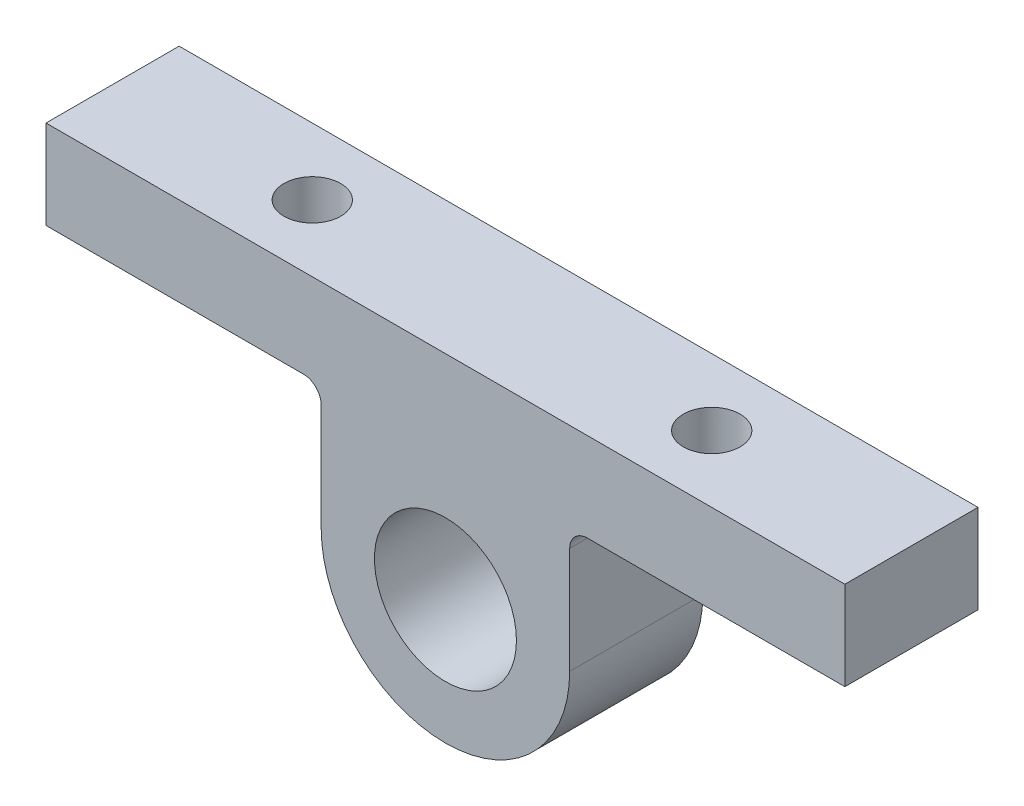
ISO-10303-21;
HEADER;
FILE_DESCRIPTION(('STEP AP214'),'2;1');
FILE_NAME('part.step','',(''),(''),'','','');
FILE_SCHEMA(('AUTOMOTIVE_DESIGN { 1 0 10303 214 1 1 1 1 }'));
ENDSEC;
DATA;
#1=APPLICATION_CONTEXT('core data for automotive mechanical design processes');
#2=APPLICATION_PROTOCOL_DEFINITION('international standard','automotive_design',2000,#1);
#3=PRODUCT_CONTEXT('',#1,'mechanical');
#4=PRODUCT('Part','Part','',(#3));
#5=PRODUCT_RELATED_PRODUCT_CATEGORY('part','',(#4));
#6=PRODUCT_DEFINITION_FORMATION('','',#4);
#7=PRODUCT_DEFINITION_CONTEXT('part definition',#1,'design');
#8=PRODUCT_DEFINITION('design','',#6,#7);
#9=PRODUCT_DEFINITION_SHAPE('','',#8);
#10=(LENGTH_UNIT() NAMED_UNIT(*) SI_UNIT(.MILLI.,.METRE.));
#11=(NAMED_UNIT(*) PLANE_ANGLE_UNIT() SI_UNIT($,.RADIAN.));
#12=(NAMED_UNIT(*) SI_UNIT($,.STERADIAN.) SOLID_ANGLE_UNIT());
#13=UNCERTAINTY_MEASURE_WITH_UNIT(LENGTH_MEASURE(1.E-05),#10,'distance_accuracy_value','');
#14=(GEOMETRIC_REPRESENTATION_CONTEXT(3) GLOBAL_UNCERTAINTY_ASSIGNED_CONTEXT((#13)) GLOBAL_UNIT_ASSIGNED_CONTEXT((#10,
#11,#12)) REPRESENTATION_CONTEXT('',''));
#15=CARTESIAN_POINT('',(0.,0.,0.));
#16=DIRECTION('',(0.,0.,1.));
#17=DIRECTION('',(1.,0.,0.));
#18=AXIS2_PLACEMENT_3D('',#15,#16,#17);
#19=CARTESIAN_POINT('',(-14.,0.,7.5));
#20=DIRECTION('',(-1.,0.,0.));
#21=DIRECTION('',(0.,0.,1.));
#22=AXIS2_PLACEMENT_3D('',#19,#20,#21);
#23=PLANE('',#22);
#24=DIRECTION('',(0.,1.,0.));
#25=VECTOR('',#24,1.);
#26=CARTESIAN_POINT('',(-14.,0.,7.5));
#27=LINE('',#26,#25);
#28=CARTESIAN_POINT('',(-14.,0.,7.5));
#29=VERTEX_POINT('',#28);
#30=CARTESIAN_POINT('',(-14.,12.,7.5));
#31=VERTEX_POINT('',#30);
#32=EDGE_CURVE('E114',#29,#31,#27,.T.);
#33=ORIENTED_EDGE('',*,*,#32,.T.);
#34=DIRECTION('',(0.,0.,-1.));
#35=VECTOR('',#34,1.);
#36=CARTESIAN_POINT('',(-14.,12.,-7.5));
#37=LINE('',#36,#35);
#38=CARTESIAN_POINT('',(-14.,12.,-7.5));
#39=VERTEX_POINT('',#38);
#40=EDGE_CURVE('E121',#31,#39,#37,.T.);
#41=ORIENTED_EDGE('',*,*,#40,.T.);
#42=DIRECTION('',(0.,1.,0.));
#43=VECTOR('',#42,1.);
#44=CARTESIAN_POINT('',(-14.,0.,-7.5));
#45=LINE('',#44,#43);
#46=CARTESIAN_POINT('',(-14.,0.,-7.5));
#47=VERTEX_POINT('',#46);
#48=EDGE_CURVE('E117',#47,#39,#45,.T.);
#49=ORIENTED_EDGE('',*,*,#48,.F.);
#50=DIRECTION('',(0.,0.,-1.));
#51=VECTOR('',#50,1.);
#52=CARTESIAN_POINT('',(-14.,0.,7.5));
#53=LINE('',#52,#51);
#54=EDGE_CURVE('E110',#29,#47,#53,.T.);
#55=ORIENTED_EDGE('',*,*,#54,.F.);
#56=EDGE_LOOP('',(#33,#41,#49,#55));
#57=FACE_BOUND('',#56,.T.);
#58=ADVANCED_FACE('F35',(#57),#23,.T.);
#59=CARTESIAN_POINT('',(0.,0.,7.5));
#60=DIRECTION('',(0.,0.,-1.));
#61=DIRECTION('',(-1.,0.,0.));
#62=AXIS2_PLACEMENT_3D('',#59,#60,#61);
#63=CYLINDRICAL_SURFACE('',#62,14.);
#64=CARTESIAN_POINT('',(0.,0.,-7.5));
#65=DIRECTION('',(0.,0.,1.));
#66=DIRECTION('',(1.,0.,0.));
#67=AXIS2_PLACEMENT_3D('',#64,#65,#66);
#68=CIRCLE('',#67,14.);
#69=CARTESIAN_POINT('',(14.,0.,-7.5));
#70=VERTEX_POINT('',#69);
#71=EDGE_CURVE('E162',#47,#70,#68,.T.);
#72=ORIENTED_EDGE('',*,*,#71,.T.);
#73=DIRECTION('',(0.,0.,-1.));
#74=VECTOR('',#73,1.);
#75=CARTESIAN_POINT('',(14.,0.,7.5));
#76=LINE('',#75,#74);
#77=CARTESIAN_POINT('',(14.,0.,7.5));
#78=VERTEX_POINT('',#77);
#79=EDGE_CURVE('E122',#78,#70,#76,.T.);
#80=ORIENTED_EDGE('',*,*,#79,.F.);
#81=CARTESIAN_POINT('',(0.,0.,7.5));
#82=DIRECTION('',(0.,0.,1.));
#83=DIRECTION('',(1.,0.,0.));
#84=AXIS2_PLACEMENT_3D('',#81,#82,#83);
#85=CIRCLE('',#84,14.);
#86=EDGE_CURVE('E126',#29,#78,#85,.T.);
#87=ORIENTED_EDGE('',*,*,#86,.F.);
#88=ORIENTED_EDGE('',*,*,#54,.T.);
#89=EDGE_LOOP('',(#72,#80,#87,#88));
#90=FACE_BOUND('',#89,.T.);
#91=ADVANCED_FACE('F127',(#90),#63,.T.);
#92=CARTESIAN_POINT('',(14.,0.,7.5));
#93=DIRECTION('',(-1.,0.,0.));
#94=DIRECTION('',(0.,0.,1.));
#95=AXIS2_PLACEMENT_3D('',#92,#93,#94);
#96=PLANE('',#95);
#97=DIRECTION('',(0.,1.,0.));
#98=VECTOR('',#97,1.);
#99=CARTESIAN_POINT('',(14.,0.,-7.5));
#100=LINE('',#99,#98);
#101=CARTESIAN_POINT('',(14.,12.,-7.5));
#102=VERTEX_POINT('',#101);
#103=EDGE_CURVE('E164',#70,#102,#100,.T.);
#104=ORIENTED_EDGE('',*,*,#103,.T.);
#105=DIRECTION('',(0.,0.,-1.));
#106=VECTOR('',#105,1.);
#107=CARTESIAN_POINT('',(14.,12.,7.5));
#108=LINE('',#107,#106);
#109=CARTESIAN_POINT('',(14.,12.,7.5));
#110=VERTEX_POINT('',#109);
#111=EDGE_CURVE('E50',#102,#110,#108,.F.);
#112=ORIENTED_EDGE('',*,*,#111,.T.);
#113=DIRECTION('',(0.,1.,0.));
#114=VECTOR('',#113,1.);
#115=CARTESIAN_POINT('',(14.,0.,7.5));
#116=LINE('',#115,#114);
#117=EDGE_CURVE('E130',#78,#110,#116,.T.);
#118=ORIENTED_EDGE('',*,*,#117,.F.);
#119=ORIENTED_EDGE('',*,*,#79,.T.);
#120=EDGE_LOOP('',(#104,#112,#118,#119));
#121=FACE_BOUND('',#120,.T.);
#122=ADVANCED_FACE('F227',(#121),#96,.F.);
#123=CARTESIAN_POINT('',(0.,14.,7.5));
#124=DIRECTION('',(0.,1.,0.));
#125=DIRECTION('',(-1.,0.,0.));
#126=AXIS2_PLACEMENT_3D('',#123,#124,#125);
#127=PLANE('',#126);
#128=CARTESIAN_POINT('',(22.5,14.,0.));
#129=DIRECTION('',(0.,-1.,0.));
#130=DIRECTION('',(0.,0.,-1.));
#131=AXIS2_PLACEMENT_3D('',#128,#129,#130);
#132=CIRCLE('',#131,3.19999999999999);
#133=CARTESIAN_POINT('',(22.5,14.,-3.19999999999999));
#134=VERTEX_POINT('',#133);
#135=EDGE_CURVE('E191',#134,#134,#132,.T.);
#136=ORIENTED_EDGE('',*,*,#135,.F.);
#137=EDGE_LOOP('',(#136));
#138=FACE_BOUND('',#137,.T.);
#139=DIRECTION('',(1.,0.,0.));
#140=VECTOR('',#139,1.);
#141=CARTESIAN_POINT('',(0.,14.,7.5));
#142=LINE('',#141,#140);
#143=CARTESIAN_POINT('',(16.,14.,7.5));
#144=VERTEX_POINT('',#143);
#145=CARTESIAN_POINT('',(45.,14.,7.5));
#146=VERTEX_POINT('',#145);
#147=EDGE_CURVE('E144',#144,#146,#142,.T.);
#148=ORIENTED_EDGE('',*,*,#147,.F.);
#149=DIRECTION('',(0.,0.,-1.));
#150=VECTOR('',#149,1.);
#151=CARTESIAN_POINT('',(16.,14.,-7.5));
#152=LINE('',#151,#150);
#153=CARTESIAN_POINT('',(16.,14.,-7.5));
#154=VERTEX_POINT('',#153);
#155=EDGE_CURVE('E196',#144,#154,#152,.T.);
#156=ORIENTED_EDGE('',*,*,#155,.T.);
#157=DIRECTION('',(1.,0.,0.));
#158=VECTOR('',#157,1.);
#159=CARTESIAN_POINT('',(0.,14.,-7.5));
#160=LINE('',#159,#158);
#161=CARTESIAN_POINT('',(45.,14.,-7.5));
#162=VERTEX_POINT('',#161);
#163=EDGE_CURVE('E166',#154,#162,#160,.T.);
#164=ORIENTED_EDGE('',*,*,#163,.T.);
#165=DIRECTION('',(0.,0.,-1.));
#166=VECTOR('',#165,1.);
#167=CARTESIAN_POINT('',(45.,14.,7.5));
#168=LINE('',#167,#166);
#169=EDGE_CURVE('E184',#146,#162,#168,.T.);
#170=ORIENTED_EDGE('',*,*,#169,.F.);
#171=EDGE_LOOP('',(#148,#156,#164,#170));
#172=FACE_BOUND('',#171,.T.);
#173=ADVANCED_FACE('F264',(#138,#172),#127,.F.);
#174=CARTESIAN_POINT('',(45.,0.,7.5));
#175=DIRECTION('',(-1.,0.,0.));
#176=DIRECTION('',(0.,0.,1.));
#177=AXIS2_PLACEMENT_3D('',#174,#175,#176);
#178=PLANE('',#177);
#179=DIRECTION('',(0.,1.,0.));
#180=VECTOR('',#179,1.);
#181=CARTESIAN_POINT('',(45.,0.,-7.5));
#182=LINE('',#181,#180);
#183=CARTESIAN_POINT('',(45.,24.,-7.5));
#184=VERTEX_POINT('',#183);
#185=EDGE_CURVE('E168',#162,#184,#182,.T.);
#186=ORIENTED_EDGE('',*,*,#185,.T.);
#187=DIRECTION('',(0.,0.,-1.));
#188=VECTOR('',#187,1.);
#189=CARTESIAN_POINT('',(45.,24.,7.5));
#190=LINE('',#189,#188);
#191=CARTESIAN_POINT('',(45.,24.,7.5));
#192=VERTEX_POINT('',#191);
#193=EDGE_CURVE('E182',#192,#184,#190,.T.);
#194=ORIENTED_EDGE('',*,*,#193,.F.);
#195=DIRECTION('',(0.,1.,0.));
#196=VECTOR('',#195,1.);
#197=CARTESIAN_POINT('',(45.,0.,7.5));
#198=LINE('',#197,#196);
#199=EDGE_CURVE('E146',#146,#192,#198,.T.);
#200=ORIENTED_EDGE('',*,*,#199,.F.);
#201=ORIENTED_EDGE('',*,*,#169,.T.);
#202=EDGE_LOOP('',(#186,#194,#200,#201));
#203=FACE_BOUND('',#202,.T.);
#204=ADVANCED_FACE('F260',(#203),#178,.F.);
#205=CARTESIAN_POINT('',(0.,24.,7.5));
#206=DIRECTION('',(0.,1.,0.));
#207=DIRECTION('',(0.,0.,1.));
#208=AXIS2_PLACEMENT_3D('',#205,#206,#207);
#209=PLANE('',#208);
#210=CARTESIAN_POINT('',(-22.5,24.,0.));
#211=DIRECTION('',(0.,1.,0.));
#212=DIRECTION('',(0.,0.,1.));
#213=AXIS2_PLACEMENT_3D('',#210,#211,#212);
#214=CIRCLE('',#213,3.19999999999999);
#215=CARTESIAN_POINT('',(-22.5,24.,3.19999999999999));
#216=VERTEX_POINT('',#215);
#217=EDGE_CURVE('E188',#216,#216,#214,.T.);
#218=ORIENTED_EDGE('',*,*,#217,.F.);
#219=EDGE_LOOP('',(#218));
#220=FACE_BOUND('',#219,.T.);
#221=CARTESIAN_POINT('',(22.5,24.,0.));
#222=DIRECTION('',(0.,1.,0.));
#223=DIRECTION('',(0.,0.,1.));
#224=AXIS2_PLACEMENT_3D('',#221,#222,#223);
#225=CIRCLE('',#224,3.19999999999999);
#226=CARTESIAN_POINT('',(22.5,24.,3.19999999999999));
#227=VERTEX_POINT('',#226);
#228=EDGE_CURVE('E160',#227,#227,#225,.T.);
#229=ORIENTED_EDGE('',*,*,#228,.F.);
#230=EDGE_LOOP('',(#229));
#231=FACE_BOUND('',#230,.T.);
#232=DIRECTION('',(1.,0.,0.));
#233=VECTOR('',#232,1.);
#234=CARTESIAN_POINT('',(0.,24.,-7.5));
#235=LINE('',#234,#233);
#236=CARTESIAN_POINT('',(-45.,24.,-7.5));
#237=VERTEX_POINT('',#236);
#238=EDGE_CURVE('E171',#237,#184,#235,.T.);
#239=ORIENTED_EDGE('',*,*,#238,.F.);
#240=DIRECTION('',(0.,0.,-1.));
#241=VECTOR('',#240,1.);
#242=CARTESIAN_POINT('',(-45.,24.,7.5));
#243=LINE('',#242,#241);
#244=CARTESIAN_POINT('',(-45.,24.,7.5));
#245=VERTEX_POINT('',#244);
#246=EDGE_CURVE('E180',#245,#237,#243,.T.);
#247=ORIENTED_EDGE('',*,*,#246,.F.);
#248=DIRECTION('',(1.,0.,0.));
#249=VECTOR('',#248,1.);
#250=CARTESIAN_POINT('',(0.,24.,7.5));
#251=LINE('',#250,#249);
#252=EDGE_CURVE('E148',#245,#192,#251,.T.);
#253=ORIENTED_EDGE('',*,*,#252,.T.);
#254=ORIENTED_EDGE('',*,*,#193,.T.);
#255=EDGE_LOOP('',(#239,#247,#253,#254));
#256=FACE_BOUND('',#255,.T.);
#257=ADVANCED_FACE('F240',(#220,#231,#256),#209,.T.);
#258=CARTESIAN_POINT('',(-45.,0.,7.5));
#259=DIRECTION('',(-1.,0.,0.));
#260=DIRECTION('',(0.,0.,1.));
#261=AXIS2_PLACEMENT_3D('',#258,#259,#260);
#262=PLANE('',#261);
#263=DIRECTION('',(0.,1.,0.));
#264=VECTOR('',#263,1.);
#265=CARTESIAN_POINT('',(-45.,0.,-7.5));
#266=LINE('',#265,#264);
#267=CARTESIAN_POINT('',(-45.,14.,-7.5));
#268=VERTEX_POINT('',#267);
#269=EDGE_CURVE('E174',#268,#237,#266,.T.);
#270=ORIENTED_EDGE('',*,*,#269,.F.);
#271=DIRECTION('',(0.,0.,-1.));
#272=VECTOR('',#271,1.);
#273=CARTESIAN_POINT('',(-45.,14.,7.5));
#274=LINE('',#273,#272);
#275=CARTESIAN_POINT('',(-45.,14.,7.5));
#276=VERTEX_POINT('',#275);
#277=EDGE_CURVE('E156',#276,#268,#274,.T.);
#278=ORIENTED_EDGE('',*,*,#277,.F.);
#279=DIRECTION('',(0.,1.,0.));
#280=VECTOR('',#279,1.);
#281=CARTESIAN_POINT('',(-45.,0.,7.5));
#282=LINE('',#281,#280);
#283=EDGE_CURVE('E151',#276,#245,#282,.T.);
#284=ORIENTED_EDGE('',*,*,#283,.T.);
#285=ORIENTED_EDGE('',*,*,#246,.T.);
#286=EDGE_LOOP('',(#270,#278,#284,#285));
#287=FACE_BOUND('',#286,.T.);
#288=ADVANCED_FACE('F232',(#287),#262,.T.);
#289=CARTESIAN_POINT('',(0.,0.,7.5));
#290=DIRECTION('',(0.,0.,-1.));
#291=DIRECTION('',(-1.,0.,0.));
#292=AXIS2_PLACEMENT_3D('',#289,#290,#291);
#293=CYLINDRICAL_SURFACE('',#292,8.);
#294=CARTESIAN_POINT('',(0.,0.,7.5));
#295=DIRECTION('',(0.,0.,1.));
#296=DIRECTION('',(1.,0.,0.));
#297=AXIS2_PLACEMENT_3D('',#294,#295,#296);
#298=CIRCLE('',#297,8.);
#299=CARTESIAN_POINT('',(8.,0.,7.5));
#300=VERTEX_POINT('',#299);
#301=EDGE_CURVE('E136',#300,#300,#298,.T.);
#302=ORIENTED_EDGE('',*,*,#301,.T.);
#303=EDGE_LOOP('',(#302));
#304=FACE_BOUND('',#303,.T.);
#305=CARTESIAN_POINT('',(0.,0.,-7.5));
#306=DIRECTION('',(0.,0.,1.));
#307=DIRECTION('',(1.,0.,0.));
#308=AXIS2_PLACEMENT_3D('',#305,#306,#307);
#309=CIRCLE('',#308,8.);
#310=CARTESIAN_POINT('',(8.,0.,-7.5));
#311=VERTEX_POINT('',#310);
#312=EDGE_CURVE('E157',#311,#311,#309,.T.);
#313=ORIENTED_EDGE('',*,*,#312,.F.);
#314=EDGE_LOOP('',(#313));
#315=FACE_BOUND('',#314,.T.);
#316=ADVANCED_FACE('F230',(#304,#315),#293,.F.);
#317=CARTESIAN_POINT('',(0.,14.,7.5));
#318=DIRECTION('',(0.,-1.,0.));
#319=DIRECTION('',(1.,0.,0.));
#320=AXIS2_PLACEMENT_3D('',#317,#318,#319);
#321=PLANE('',#320);
#322=CARTESIAN_POINT('',(-22.5,14.,0.));
#323=DIRECTION('',(0.,-1.,0.));
#324=DIRECTION('',(0.,0.,-1.));
#325=AXIS2_PLACEMENT_3D('',#322,#323,#324);
#326=CIRCLE('',#325,3.19999999999999);
#327=CARTESIAN_POINT('',(-22.5,14.,-3.19999999999999));
#328=VERTEX_POINT('',#327);
#329=EDGE_CURVE('E192',#328,#328,#326,.T.);
#330=ORIENTED_EDGE('',*,*,#329,.F.);
#331=EDGE_LOOP('',(#330));
#332=FACE_BOUND('',#331,.T.);
#333=DIRECTION('',(-1.,0.,0.));
#334=VECTOR('',#333,1.);
#335=CARTESIAN_POINT('',(0.,14.,-7.5));
#336=LINE('',#335,#334);
#337=CARTESIAN_POINT('',(-16.,14.,-7.5));
#338=VERTEX_POINT('',#337);
#339=EDGE_CURVE('E139',#338,#268,#336,.T.);
#340=ORIENTED_EDGE('',*,*,#339,.F.);
#341=DIRECTION('',(0.,0.,-1.));
#342=VECTOR('',#341,1.);
#343=CARTESIAN_POINT('',(-16.,14.,7.5));
#344=LINE('',#343,#342);
#345=CARTESIAN_POINT('',(-16.,14.,7.5));
#346=VERTEX_POINT('',#345);
#347=EDGE_CURVE('E194',#338,#346,#344,.F.);
#348=ORIENTED_EDGE('',*,*,#347,.T.);
#349=DIRECTION('',(-1.,0.,0.));
#350=VECTOR('',#349,1.);
#351=CARTESIAN_POINT('',(0.,14.,7.5));
#352=LINE('',#351,#350);
#353=EDGE_CURVE('E154',#346,#276,#352,.T.);
#354=ORIENTED_EDGE('',*,*,#353,.T.);
#355=ORIENTED_EDGE('',*,*,#277,.T.);
#356=EDGE_LOOP('',(#340,#348,#354,#355));
#357=FACE_BOUND('',#356,.T.);
#358=ADVANCED_FACE('F207',(#332,#357),#321,.T.);
#359=CARTESIAN_POINT('',(0.,0.,7.5));
#360=DIRECTION('',(0.,0.,1.));
#361=DIRECTION('',(1.,0.,0.));
#362=AXIS2_PLACEMENT_3D('',#359,#360,#361);
#363=PLANE('',#362);
#364=ORIENTED_EDGE('',*,*,#301,.F.);
#365=EDGE_LOOP('',(#364));
#366=FACE_BOUND('',#365,.T.);
#367=ORIENTED_EDGE('',*,*,#32,.F.);
#368=ORIENTED_EDGE('',*,*,#86,.T.);
#369=ORIENTED_EDGE('',*,*,#117,.T.);
#370=CARTESIAN_POINT('',(16.,12.,7.5));
#371=DIRECTION('',(0.,0.,1.));
#372=DIRECTION('',(1.,0.,0.));
#373=AXIS2_PLACEMENT_3D('',#370,#371,#372);
#374=CIRCLE('',#373,2.);
#375=EDGE_CURVE('E11',#110,#144,#374,.F.);
#376=ORIENTED_EDGE('',*,*,#375,.T.);
#377=ORIENTED_EDGE('',*,*,#147,.T.);
#378=ORIENTED_EDGE('',*,*,#199,.T.);
#379=ORIENTED_EDGE('',*,*,#252,.F.);
#380=ORIENTED_EDGE('',*,*,#283,.F.);
#381=ORIENTED_EDGE('',*,*,#353,.F.);
#382=CARTESIAN_POINT('',(-16.,12.,7.5));
#383=DIRECTION('',(0.,0.,1.));
#384=DIRECTION('',(1.,0.,0.));
#385=AXIS2_PLACEMENT_3D('',#382,#383,#384);
#386=CIRCLE('',#385,2.);
#387=EDGE_CURVE('E135',#346,#31,#386,.F.);
#388=ORIENTED_EDGE('',*,*,#387,.T.);
#389=EDGE_LOOP('',(#367,#368,#369,#376,#377,#378,#379,#380,#381,#388));
#390=FACE_BOUND('',#389,.T.);
#391=ADVANCED_FACE('F132',(#366,#390),#363,.T.);
#392=CARTESIAN_POINT('',(0.,0.,-7.5));
#393=DIRECTION('',(0.,0.,1.));
#394=DIRECTION('',(1.,0.,0.));
#395=AXIS2_PLACEMENT_3D('',#392,#393,#394);
#396=PLANE('',#395);
#397=ORIENTED_EDGE('',*,*,#312,.T.);
#398=EDGE_LOOP('',(#397));
#399=FACE_BOUND('',#398,.T.);
#400=ORIENTED_EDGE('',*,*,#48,.T.);
#401=CARTESIAN_POINT('',(-16.,12.,-7.5));
#402=DIRECTION('',(0.,0.,1.));
#403=DIRECTION('',(1.,0.,0.));
#404=AXIS2_PLACEMENT_3D('',#401,#402,#403);
#405=CIRCLE('',#404,2.);
#406=EDGE_CURVE('E200',#39,#338,#405,.T.);
#407=ORIENTED_EDGE('',*,*,#406,.T.);
#408=ORIENTED_EDGE('',*,*,#339,.T.);
#409=ORIENTED_EDGE('',*,*,#269,.T.);
#410=ORIENTED_EDGE('',*,*,#238,.T.);
#411=ORIENTED_EDGE('',*,*,#185,.F.);
#412=ORIENTED_EDGE('',*,*,#163,.F.);
#413=CARTESIAN_POINT('',(16.,12.,-7.5));
#414=DIRECTION('',(0.,0.,1.));
#415=DIRECTION('',(1.,0.,0.));
#416=AXIS2_PLACEMENT_3D('',#413,#414,#415);
#417=CIRCLE('',#416,2.);
#418=EDGE_CURVE('E43',#154,#102,#417,.T.);
#419=ORIENTED_EDGE('',*,*,#418,.T.);
#420=ORIENTED_EDGE('',*,*,#103,.F.);
#421=ORIENTED_EDGE('',*,*,#71,.F.);
#422=EDGE_LOOP('',(#400,#407,#408,#409,#410,#411,#412,#419,#420,#421));
#423=FACE_BOUND('',#422,.T.);
#424=ADVANCED_FACE('F203',(#399,#423),#396,.F.);
#425=CARTESIAN_POINT('',(22.5,14.,0.));
#426=DIRECTION('',(0.,-1.,0.));
#427=DIRECTION('',(0.,0.,-1.));
#428=AXIS2_PLACEMENT_3D('',#425,#426,#427);
#429=CYLINDRICAL_SURFACE('',#428,3.19999999999999);
#430=ORIENTED_EDGE('',*,*,#228,.T.);
#431=EDGE_LOOP('',(#430));
#432=FACE_BOUND('',#431,.T.);
#433=ORIENTED_EDGE('',*,*,#135,.T.);
#434=EDGE_LOOP('',(#433));
#435=FACE_BOUND('',#434,.T.);
#436=ADVANCED_FACE('F218',(#432,#435),#429,.F.);
#437=CARTESIAN_POINT('',(-22.5,14.,0.));
#438=DIRECTION('',(0.,-1.,0.));
#439=DIRECTION('',(0.,0.,-1.));
#440=AXIS2_PLACEMENT_3D('',#437,#438,#439);
#441=CYLINDRICAL_SURFACE('',#440,3.19999999999999);
#442=ORIENTED_EDGE('',*,*,#217,.T.);
#443=EDGE_LOOP('',(#442));
#444=FACE_BOUND('',#443,.T.);
#445=ORIENTED_EDGE('',*,*,#329,.T.);
#446=EDGE_LOOP('',(#445));
#447=FACE_BOUND('',#446,.T.);
#448=ADVANCED_FACE('F212',(#444,#447),#441,.F.);
#449=CARTESIAN_POINT('',(-16.,12.,7.5));
#450=DIRECTION('',(0.,0.,1.));
#451=DIRECTION('',(1.,0.,0.));
#452=AXIS2_PLACEMENT_3D('',#449,#450,#451);
#453=CYLINDRICAL_SURFACE('',#452,2.);
#454=ORIENTED_EDGE('',*,*,#387,.F.);
#455=ORIENTED_EDGE('',*,*,#347,.F.);
#456=ORIENTED_EDGE('',*,*,#406,.F.);
#457=ORIENTED_EDGE('',*,*,#40,.F.);
#458=EDGE_LOOP('',(#454,#455,#456,#457));
#459=FACE_BOUND('',#458,.T.);
#460=ADVANCED_FACE('F210',(#459),#453,.F.);
#461=CARTESIAN_POINT('',(16.,12.,7.5));
#462=DIRECTION('',(0.,0.,1.));
#463=DIRECTION('',(1.,0.,0.));
#464=AXIS2_PLACEMENT_3D('',#461,#462,#463);
#465=CYLINDRICAL_SURFACE('',#464,2.);
#466=ORIENTED_EDGE('',*,*,#375,.F.);
#467=ORIENTED_EDGE('',*,*,#111,.F.);
#468=ORIENTED_EDGE('',*,*,#418,.F.);
#469=ORIENTED_EDGE('',*,*,#155,.F.);
#470=EDGE_LOOP('',(#466,#467,#468,#469));
#471=FACE_BOUND('',#470,.T.);
#472=ADVANCED_FACE('F37',(#471),#465,.F.);
#473=CLOSED_SHELL('',(#58,#91,#122,#173,#204,#257,#288,#316,#358,#391,#424,#436,#448,#460,#472));
#474=MANIFOLD_SOLID_BREP('B2',#473);
#475=ADVANCED_BREP_SHAPE_REPRESENTATION('',(#18,#474),#14);
#476=SHAPE_DEFINITION_REPRESENTATION(#9,#475);
ENDSEC;
END-ISO-10303-21;
